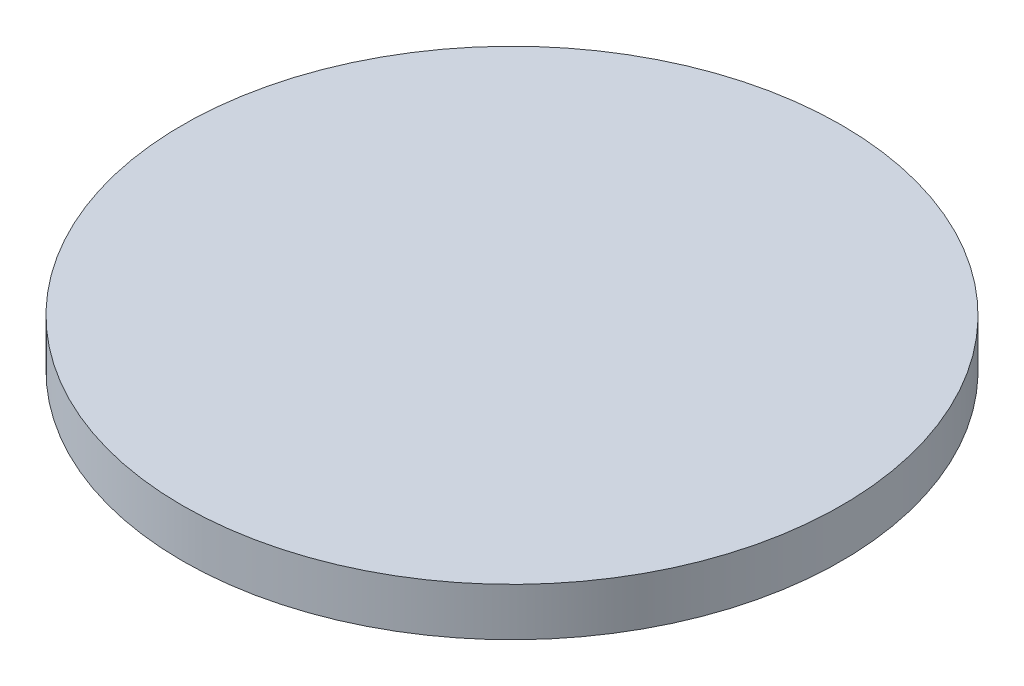
ISO-10303-21;
HEADER;
FILE_DESCRIPTION(('STEP AP214'),'2;1');
FILE_NAME('part.step','',(''),(''),'','','');
FILE_SCHEMA(('AUTOMOTIVE_DESIGN { 1 0 10303 214 1 1 1 1 }'));
ENDSEC;
DATA;
#1=APPLICATION_CONTEXT('core data for automotive mechanical design processes');
#2=APPLICATION_PROTOCOL_DEFINITION('international standard','automotive_design',2000,#1);
#3=PRODUCT_CONTEXT('',#1,'mechanical');
#4=PRODUCT('Part','Part','',(#3));
#5=PRODUCT_RELATED_PRODUCT_CATEGORY('part','',(#4));
#6=PRODUCT_DEFINITION_FORMATION('','',#4);
#7=PRODUCT_DEFINITION_CONTEXT('part definition',#1,'design');
#8=PRODUCT_DEFINITION('design','',#6,#7);
#9=PRODUCT_DEFINITION_SHAPE('','',#8);
#10=(LENGTH_UNIT() NAMED_UNIT(*) SI_UNIT(.MILLI.,.METRE.));
#11=(NAMED_UNIT(*) PLANE_ANGLE_UNIT() SI_UNIT($,.RADIAN.));
#12=(NAMED_UNIT(*) SI_UNIT($,.STERADIAN.) SOLID_ANGLE_UNIT());
#13=UNCERTAINTY_MEASURE_WITH_UNIT(LENGTH_MEASURE(1.E-05),#10,'distance_accuracy_value','');
#14=(GEOMETRIC_REPRESENTATION_CONTEXT(3) GLOBAL_UNCERTAINTY_ASSIGNED_CONTEXT((#13)) GLOBAL_UNIT_ASSIGNED_CONTEXT((#10,
#11,#12)) REPRESENTATION_CONTEXT('',''));
#15=CARTESIAN_POINT('',(0.,0.,0.));
#16=DIRECTION('',(0.,0.,1.));
#17=DIRECTION('',(1.,0.,0.));
#18=AXIS2_PLACEMENT_3D('',#15,#16,#17);
#19=CARTESIAN_POINT('',(91.816549826853,24.418326303827,48.1630816592988));
#20=DIRECTION('',(0.,-1.,0.));
#21=DIRECTION('',(0.,0.,-1.));
#22=AXIS2_PLACEMENT_3D('',#19,#20,#21);
#23=CYLINDRICAL_SURFACE('',#22,17.4500000000006);
#24=CARTESIAN_POINT('',(91.816549826853,24.418326303827,48.1630816592988));
#25=DIRECTION('',(0.,1.,0.));
#26=DIRECTION('',(0.,0.,1.));
#27=AXIS2_PLACEMENT_3D('',#24,#25,#26);
#28=CIRCLE('',#27,17.4500000000006);
#29=CARTESIAN_POINT('',(91.816549826853,24.418326303827,65.6130816592994));
#30=VERTEX_POINT('',#29);
#31=EDGE_CURVE('E10',#30,#30,#28,.T.);
#32=ORIENTED_EDGE('',*,*,#31,.F.);
#33=EDGE_LOOP('',(#32));
#34=FACE_BOUND('',#33,.T.);
#35=CARTESIAN_POINT('',(91.816549826853,21.878326303827,48.1630816592987));
#36=DIRECTION('',(0.,1.,0.));
#37=DIRECTION('',(0.,0.,1.));
#38=AXIS2_PLACEMENT_3D('',#35,#36,#37);
#39=CIRCLE('',#38,17.4500000000006);
#40=CARTESIAN_POINT('',(91.816549826853,21.878326303827,65.6130816592994));
#41=VERTEX_POINT('',#40);
#42=EDGE_CURVE('E34',#41,#41,#39,.T.);
#43=ORIENTED_EDGE('',*,*,#42,.T.);
#44=EDGE_LOOP('',(#43));
#45=FACE_BOUND('',#44,.T.);
#46=ADVANCED_FACE('F31',(#34,#45),#23,.T.);
#47=CARTESIAN_POINT('',(91.816549826853,24.418326303827,48.1630816592988));
#48=DIRECTION('',(0.,1.,0.));
#49=DIRECTION('',(0.,0.,1.));
#50=AXIS2_PLACEMENT_3D('',#47,#48,#49);
#51=PLANE('',#50);
#52=ORIENTED_EDGE('',*,*,#31,.T.);
#53=EDGE_LOOP('',(#52));
#54=FACE_BOUND('',#53,.T.);
#55=ADVANCED_FACE('F46',(#54),#51,.T.);
#56=CARTESIAN_POINT('',(91.816549826853,21.878326303827,48.1630816592987));
#57=DIRECTION('',(0.,1.,0.));
#58=DIRECTION('',(0.,0.,1.));
#59=AXIS2_PLACEMENT_3D('',#56,#57,#58);
#60=PLANE('',#59);
#61=ORIENTED_EDGE('',*,*,#42,.F.);
#62=EDGE_LOOP('',(#61));
#63=FACE_BOUND('',#62,.T.);
#64=ADVANCED_FACE('F44',(#63),#60,.F.);
#65=CLOSED_SHELL('',(#46,#55,#64));
#66=MANIFOLD_SOLID_BREP('B2',#65);
#67=ADVANCED_BREP_SHAPE_REPRESENTATION('',(#18,#66),#14);
#68=SHAPE_DEFINITION_REPRESENTATION(#9,#67);
ENDSEC;
END-ISO-10303-21;
